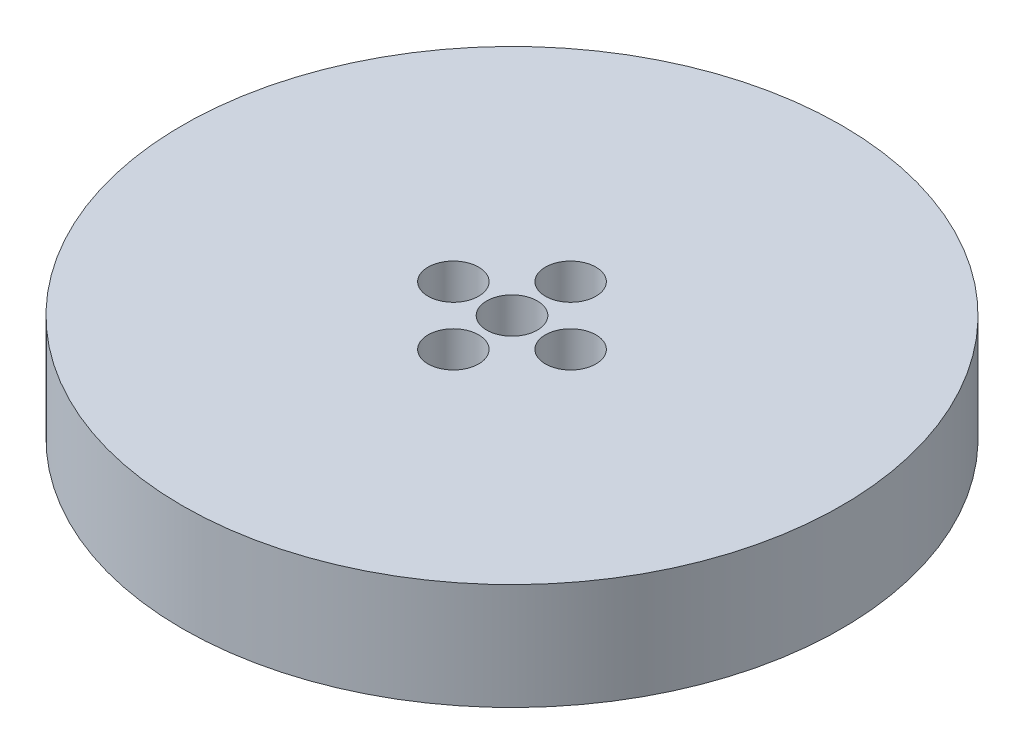
ISO-10303-21;
HEADER;
FILE_DESCRIPTION(('STEP AP214'),'2;1');
FILE_NAME('part.step','',(''),(''),'','','');
FILE_SCHEMA(('AUTOMOTIVE_DESIGN { 1 0 10303 214 1 1 1 1 }'));
ENDSEC;
DATA;
#1=APPLICATION_CONTEXT('core data for automotive mechanical design processes');
#2=APPLICATION_PROTOCOL_DEFINITION('international standard','automotive_design',2000,#1);
#3=PRODUCT_CONTEXT('',#1,'mechanical');
#4=PRODUCT('Part','Part','',(#3));
#5=PRODUCT_RELATED_PRODUCT_CATEGORY('part','',(#4));
#6=PRODUCT_DEFINITION_FORMATION('','',#4);
#7=PRODUCT_DEFINITION_CONTEXT('part definition',#1,'design');
#8=PRODUCT_DEFINITION('design','',#6,#7);
#9=PRODUCT_DEFINITION_SHAPE('','',#8);
#10=(LENGTH_UNIT() NAMED_UNIT(*) SI_UNIT(.MILLI.,.METRE.));
#11=(NAMED_UNIT(*) PLANE_ANGLE_UNIT() SI_UNIT($,.RADIAN.));
#12=(NAMED_UNIT(*) SI_UNIT($,.STERADIAN.) SOLID_ANGLE_UNIT());
#13=UNCERTAINTY_MEASURE_WITH_UNIT(LENGTH_MEASURE(1.E-05),#10,'distance_accuracy_value','');
#14=(GEOMETRIC_REPRESENTATION_CONTEXT(3) GLOBAL_UNCERTAINTY_ASSIGNED_CONTEXT((#13)) GLOBAL_UNIT_ASSIGNED_CONTEXT((#10,
#11,#12)) REPRESENTATION_CONTEXT('',''));
#15=CARTESIAN_POINT('',(0.,0.,0.));
#16=DIRECTION('',(0.,0.,1.));
#17=DIRECTION('',(1.,0.,0.));
#18=AXIS2_PLACEMENT_3D('',#15,#16,#17);
#19=CARTESIAN_POINT('',(0.,21.,0.));
#20=DIRECTION('',(0.,-1.,0.));
#21=DIRECTION('',(0.,0.,-1.));
#22=AXIS2_PLACEMENT_3D('',#19,#20,#21);
#23=CYLINDRICAL_SURFACE('',#22,65.);
#24=CARTESIAN_POINT('',(0.,21.,0.));
#25=DIRECTION('',(0.,1.,0.));
#26=DIRECTION('',(0.,0.,1.));
#27=AXIS2_PLACEMENT_3D('',#24,#25,#26);
#28=CIRCLE('',#27,65.);
#29=CARTESIAN_POINT('',(0.,21.,-65.));
#30=VERTEX_POINT('',#29);
#31=EDGE_CURVE('E10',#30,#30,#28,.T.);
#32=CARTESIAN_POINT('',(0.,0.,0.));
#33=DIRECTION('',(0.,1.,0.));
#34=DIRECTION('',(0.,0.,1.));
#35=AXIS2_PLACEMENT_3D('',#32,#33,#34);
#36=CIRCLE('',#35,65.);
#37=CARTESIAN_POINT('',(0.,0.,-65.));
#38=VERTEX_POINT('',#37);
#39=EDGE_CURVE('E37',#38,#38,#36,.T.);
#40=CARTESIAN_POINT('',(0.,21.,-65.));
#41=CARTESIAN_POINT('',(0.,20.78125,-65.));
#42=CARTESIAN_POINT('',(0.,20.5625,-65.));
#43=CARTESIAN_POINT('',(0.,20.125,-65.));
#44=CARTESIAN_POINT('',(0.,19.90625,-65.));
#45=CARTESIAN_POINT('',(0.,19.46875,-65.));
#46=CARTESIAN_POINT('',(0.,19.25,-65.));
#47=CARTESIAN_POINT('',(0.,18.8125,-65.));
#48=CARTESIAN_POINT('',(0.,18.59375,-65.));
#49=CARTESIAN_POINT('',(0.,18.15625,-65.));
#50=CARTESIAN_POINT('',(0.,17.9375,-65.));
#51=CARTESIAN_POINT('',(0.,17.5,-65.));
#52=CARTESIAN_POINT('',(0.,17.28125,-65.));
#53=CARTESIAN_POINT('',(0.,16.84375,-65.));
#54=CARTESIAN_POINT('',(0.,16.625,-65.));
#55=CARTESIAN_POINT('',(0.,16.1875,-65.));
#56=CARTESIAN_POINT('',(0.,15.96875,-65.));
#57=CARTESIAN_POINT('',(0.,15.53125,-65.));
#58=CARTESIAN_POINT('',(0.,15.3125,-65.));
#59=CARTESIAN_POINT('',(0.,14.875,-65.));
#60=CARTESIAN_POINT('',(0.,14.65625,-65.));
#61=CARTESIAN_POINT('',(0.,14.21875,-65.));
#62=CARTESIAN_POINT('',(0.,14.,-65.));
#63=CARTESIAN_POINT('',(0.,13.5625,-65.));
#64=CARTESIAN_POINT('',(0.,13.34375,-65.));
#65=CARTESIAN_POINT('',(0.,12.90625,-65.));
#66=CARTESIAN_POINT('',(0.,12.6875,-65.));
#67=CARTESIAN_POINT('',(0.,12.25,-65.));
#68=CARTESIAN_POINT('',(0.,12.03125,-65.));
#69=CARTESIAN_POINT('',(0.,11.59375,-65.));
#70=CARTESIAN_POINT('',(0.,11.375,-65.));
#71=CARTESIAN_POINT('',(0.,10.9375,-65.));
#72=CARTESIAN_POINT('',(0.,10.71875,-65.));
#73=CARTESIAN_POINT('',(0.,10.28125,-65.));
#74=CARTESIAN_POINT('',(0.,10.0625,-65.));
#75=CARTESIAN_POINT('',(0.,9.625,-65.));
#76=CARTESIAN_POINT('',(0.,9.40625,-65.));
#77=CARTESIAN_POINT('',(0.,8.96875,-65.));
#78=CARTESIAN_POINT('',(0.,8.75,-65.));
#79=CARTESIAN_POINT('',(0.,8.3125,-65.));
#80=CARTESIAN_POINT('',(0.,8.09375,-65.));
#81=CARTESIAN_POINT('',(0.,7.65625,-65.));
#82=CARTESIAN_POINT('',(0.,7.4375,-65.));
#83=CARTESIAN_POINT('',(0.,7.,-65.));
#84=CARTESIAN_POINT('',(0.,6.78125,-65.));
#85=CARTESIAN_POINT('',(0.,6.34375,-65.));
#86=CARTESIAN_POINT('',(0.,6.125,-65.));
#87=CARTESIAN_POINT('',(0.,5.6875,-65.));
#88=CARTESIAN_POINT('',(0.,5.46875,-65.));
#89=CARTESIAN_POINT('',(0.,5.03125,-65.));
#90=CARTESIAN_POINT('',(0.,4.8125,-65.));
#91=CARTESIAN_POINT('',(0.,4.375,-65.));
#92=CARTESIAN_POINT('',(0.,4.15625,-65.));
#93=CARTESIAN_POINT('',(0.,3.71875,-65.));
#94=CARTESIAN_POINT('',(0.,3.5,-65.));
#95=CARTESIAN_POINT('',(0.,3.0625,-65.));
#96=CARTESIAN_POINT('',(0.,2.84375,-65.));
#97=CARTESIAN_POINT('',(0.,2.40625,-65.));
#98=CARTESIAN_POINT('',(0.,2.1875,-65.));
#99=CARTESIAN_POINT('',(0.,1.75,-65.));
#100=CARTESIAN_POINT('',(0.,1.53125,-65.));
#101=CARTESIAN_POINT('',(0.,1.09375,-65.));
#102=CARTESIAN_POINT('',(0.,0.875000000000001,-65.));
#103=CARTESIAN_POINT('',(0.,0.4375,-65.));
#104=CARTESIAN_POINT('',(0.,0.21875,-65.));
#105=CARTESIAN_POINT('',(0.,0.,-65.));
#106=B_SPLINE_CURVE_WITH_KNOTS('',3,(#40,#41,#42,#43,#44,#45,#46,#47,#48,#49,#50,#51,#52,#53,
#54,#55,#56,#57,#58,#59,#60,#61,#62,#63,#64,#65,#66,#67,#68,#69,#70,#71,#72,#73,#74,#75,#76,#77,
#78,#79,#80,#81,#82,#83,#84,#85,#86,#87,#88,#89,#90,#91,#92,#93,#94,#95,#96,#97,#98,#99,#100,
#101,#102,#103,#104,#105),.UNSPECIFIED.,.F.,.F.,(4,2,2,2,2,2,2,2,2,2,2,2,2,2,2,2,2,2,2,2,2,2,2,
2,2,2,2,2,2,2,2,2,4),(0.,0.656249999999997,1.3125,1.96875,2.625,3.28125,3.9375,4.59375,5.25,
5.90625,6.5625,7.21875,7.875,8.53125,9.1875,9.84375,10.5,11.15625,11.8125,12.46875,13.125,
13.78125,14.4375,15.09375,15.75,16.40625,17.0625,17.71875,18.375,19.03125,19.6875,20.34375,21.),.UNSPECIFIED.);
#107=EDGE_CURVE('BSEAM40',#30,#38,#106,.T.);
#108=ORIENTED_EDGE('',*,*,#31,.F.);
#109=ORIENTED_EDGE('',*,*,#39,.T.);
#110=ORIENTED_EDGE('',*,*,#107,.T.);
#111=ORIENTED_EDGE('',*,*,#107,.F.);
#112=EDGE_LOOP('',(#108,#110,#109,#111));
#113=FACE_BOUND('',#112,.T.);
#114=ADVANCED_FACE('F40',(#113),#23,.T.);
#115=CARTESIAN_POINT('',(0.,21.,0.));
#116=DIRECTION('',(0.,1.,0.));
#117=DIRECTION('',(0.,0.,1.));
#118=AXIS2_PLACEMENT_3D('',#115,#116,#117);
#119=PLANE('',#118);
#120=CARTESIAN_POINT('',(0.,21.,11.566878070459));
#121=DIRECTION('',(0.,1.,0.));
#122=DIRECTION('',(1.,0.,0.));
#123=AXIS2_PLACEMENT_3D('',#120,#121,#122);
#124=CIRCLE('',#123,4.98679283531903);
#125=CARTESIAN_POINT('',(4.98679283531908,21.,11.5668780704589));
#126=VERTEX_POINT('',#125);
#127=EDGE_CURVE('E71',#126,#126,#124,.T.);
#128=ORIENTED_EDGE('',*,*,#127,.F.);
#129=EDGE_LOOP('',(#128));
#130=FACE_BOUND('',#129,.T.);
#131=CARTESIAN_POINT('',(11.566878070459,21.,0.));
#132=DIRECTION('',(0.,1.,0.));
#133=DIRECTION('',(0.,0.,-1.));
#134=AXIS2_PLACEMENT_3D('',#131,#132,#133);
#135=CIRCLE('',#134,4.98679283531903);
#136=CARTESIAN_POINT('',(11.566878070459,21.,-4.98679283531903));
#137=VERTEX_POINT('',#136);
#138=EDGE_CURVE('E70',#137,#137,#135,.T.);
#139=ORIENTED_EDGE('',*,*,#138,.F.);
#140=EDGE_LOOP('',(#139));
#141=FACE_BOUND('',#140,.T.);
#142=CARTESIAN_POINT('',(-1.21156616795044E-13,21.,-11.566878070459));
#143=DIRECTION('',(0.,1.,0.));
#144=DIRECTION('',(-1.,0.,0.));
#145=AXIS2_PLACEMENT_3D('',#142,#143,#144);
#146=CIRCLE('',#145,4.98679283531903);
#147=CARTESIAN_POINT('',(-4.98679283531916,21.,-11.5668780704589));
#148=VERTEX_POINT('',#147);
#149=EDGE_CURVE('E61',#148,#148,#146,.T.);
#150=ORIENTED_EDGE('',*,*,#149,.F.);
#151=EDGE_LOOP('',(#150));
#152=FACE_BOUND('',#151,.T.);
#153=CARTESIAN_POINT('',(-11.566878070459,21.,0.));
#154=DIRECTION('',(0.,1.,0.));
#155=DIRECTION('',(0.,0.,1.));
#156=AXIS2_PLACEMENT_3D('',#153,#154,#155);
#157=CIRCLE('',#156,4.98679283531903);
#158=CARTESIAN_POINT('',(-11.566878070459,21.,4.98679283531903));
#159=VERTEX_POINT('',#158);
#160=EDGE_CURVE('E54',#159,#159,#157,.T.);
#161=ORIENTED_EDGE('',*,*,#160,.F.);
#162=EDGE_LOOP('',(#161));
#163=FACE_BOUND('',#162,.T.);
#164=CARTESIAN_POINT('',(0.,21.,0.));
#165=DIRECTION('',(0.,1.,0.));
#166=DIRECTION('',(0.,0.,1.));
#167=AXIS2_PLACEMENT_3D('',#164,#165,#166);
#168=CIRCLE('',#167,5.);
#169=CARTESIAN_POINT('',(0.,21.,-5.));
#170=VERTEX_POINT('',#169);
#171=EDGE_CURVE('E50',#170,#170,#168,.T.);
#172=ORIENTED_EDGE('',*,*,#171,.F.);
#173=EDGE_LOOP('',(#172));
#174=FACE_BOUND('',#173,.T.);
#175=ORIENTED_EDGE('',*,*,#31,.T.);
#176=EDGE_LOOP('',(#175));
#177=FACE_BOUND('',#176,.T.);
#178=ADVANCED_FACE('F86',(#130,#141,#152,#163,#174,#177),#119,.T.);
#179=CARTESIAN_POINT('',(0.,0.,0.));
#180=DIRECTION('',(0.,1.,0.));
#181=DIRECTION('',(0.,0.,1.));
#182=AXIS2_PLACEMENT_3D('',#179,#180,#181);
#183=PLANE('',#182);
#184=CARTESIAN_POINT('',(0.,0.,0.));
#185=DIRECTION('',(0.,1.,0.));
#186=DIRECTION('',(0.,0.,1.));
#187=AXIS2_PLACEMENT_3D('',#184,#185,#186);
#188=CIRCLE('',#187,5.);
#189=CARTESIAN_POINT('',(0.,0.,-5.));
#190=VERTEX_POINT('',#189);
#191=EDGE_CURVE('E47',#190,#190,#188,.T.);
#192=ORIENTED_EDGE('',*,*,#191,.T.);
#193=EDGE_LOOP('',(#192));
#194=FACE_BOUND('',#193,.T.);
#195=ORIENTED_EDGE('',*,*,#39,.F.);
#196=EDGE_LOOP('',(#195));
#197=FACE_BOUND('',#196,.T.);
#198=ADVANCED_FACE('F93',(#194,#197),#183,.F.);
#199=CARTESIAN_POINT('',(0.,21.,0.));
#200=DIRECTION('',(0.,-1.,0.));
#201=DIRECTION('',(0.,0.,-1.));
#202=AXIS2_PLACEMENT_3D('',#199,#200,#201);
#203=CYLINDRICAL_SURFACE('',#202,5.);
#204=CARTESIAN_POINT('',(0.,21.,-5.));
#205=CARTESIAN_POINT('',(0.,20.78125,-5.));
#206=CARTESIAN_POINT('',(0.,20.5625,-5.));
#207=CARTESIAN_POINT('',(0.,20.125,-5.));
#208=CARTESIAN_POINT('',(0.,19.90625,-5.));
#209=CARTESIAN_POINT('',(0.,19.46875,-5.));
#210=CARTESIAN_POINT('',(0.,19.25,-5.));
#211=CARTESIAN_POINT('',(0.,18.8125,-5.));
#212=CARTESIAN_POINT('',(0.,18.59375,-5.));
#213=CARTESIAN_POINT('',(0.,18.15625,-5.));
#214=CARTESIAN_POINT('',(0.,17.9375,-5.));
#215=CARTESIAN_POINT('',(0.,17.5,-5.));
#216=CARTESIAN_POINT('',(0.,17.28125,-5.));
#217=CARTESIAN_POINT('',(0.,16.84375,-5.));
#218=CARTESIAN_POINT('',(0.,16.625,-5.));
#219=CARTESIAN_POINT('',(0.,16.1875,-5.));
#220=CARTESIAN_POINT('',(0.,15.96875,-5.));
#221=CARTESIAN_POINT('',(0.,15.53125,-5.));
#222=CARTESIAN_POINT('',(0.,15.3125,-5.));
#223=CARTESIAN_POINT('',(0.,14.875,-5.));
#224=CARTESIAN_POINT('',(0.,14.65625,-5.));
#225=CARTESIAN_POINT('',(0.,14.21875,-5.));
#226=CARTESIAN_POINT('',(0.,14.,-5.));
#227=CARTESIAN_POINT('',(0.,13.5625,-5.));
#228=CARTESIAN_POINT('',(0.,13.34375,-5.));
#229=CARTESIAN_POINT('',(0.,12.90625,-5.));
#230=CARTESIAN_POINT('',(0.,12.6875,-5.));
#231=CARTESIAN_POINT('',(0.,12.25,-5.));
#232=CARTESIAN_POINT('',(0.,12.03125,-5.));
#233=CARTESIAN_POINT('',(0.,11.59375,-5.));
#234=CARTESIAN_POINT('',(0.,11.375,-5.));
#235=CARTESIAN_POINT('',(0.,10.9375,-5.));
#236=CARTESIAN_POINT('',(0.,10.71875,-5.));
#237=CARTESIAN_POINT('',(0.,10.28125,-5.));
#238=CARTESIAN_POINT('',(0.,10.0625,-5.));
#239=CARTESIAN_POINT('',(0.,9.625,-5.));
#240=CARTESIAN_POINT('',(0.,9.40625,-5.));
#241=CARTESIAN_POINT('',(0.,8.96875,-5.));
#242=CARTESIAN_POINT('',(0.,8.75,-5.));
#243=CARTESIAN_POINT('',(0.,8.3125,-5.));
#244=CARTESIAN_POINT('',(0.,8.09375,-5.));
#245=CARTESIAN_POINT('',(0.,7.65625,-5.));
#246=CARTESIAN_POINT('',(0.,7.4375,-5.));
#247=CARTESIAN_POINT('',(0.,7.,-5.));
#248=CARTESIAN_POINT('',(0.,6.78125,-5.));
#249=CARTESIAN_POINT('',(0.,6.34375,-5.));
#250=CARTESIAN_POINT('',(0.,6.125,-5.));
#251=CARTESIAN_POINT('',(0.,5.6875,-5.));
#252=CARTESIAN_POINT('',(0.,5.46875,-5.));
#253=CARTESIAN_POINT('',(0.,5.03125,-5.));
#254=CARTESIAN_POINT('',(0.,4.8125,-5.));
#255=CARTESIAN_POINT('',(0.,4.375,-5.));
#256=CARTESIAN_POINT('',(0.,4.15625,-5.));
#257=CARTESIAN_POINT('',(0.,3.71875,-5.));
#258=CARTESIAN_POINT('',(0.,3.5,-5.));
#259=CARTESIAN_POINT('',(0.,3.0625,-5.));
#260=CARTESIAN_POINT('',(0.,2.84375,-5.));
#261=CARTESIAN_POINT('',(0.,2.40625,-5.));
#262=CARTESIAN_POINT('',(0.,2.1875,-5.));
#263=CARTESIAN_POINT('',(0.,1.75,-5.));
#264=CARTESIAN_POINT('',(0.,1.53125,-5.));
#265=CARTESIAN_POINT('',(0.,1.09375,-5.));
#266=CARTESIAN_POINT('',(0.,0.875000000000001,-5.));
#267=CARTESIAN_POINT('',(0.,0.4375,-5.));
#268=CARTESIAN_POINT('',(0.,0.21875,-5.));
#269=CARTESIAN_POINT('',(0.,0.,-5.));
#270=B_SPLINE_CURVE_WITH_KNOTS('',3,(#204,#205,#206,#207,#208,#209,#210,#211,#212,#213,#214,
#215,#216,#217,#218,#219,#220,#221,#222,#223,#224,#225,#226,#227,#228,#229,#230,#231,#232,#233,
#234,#235,#236,#237,#238,#239,#240,#241,#242,#243,#244,#245,#246,#247,#248,#249,#250,#251,#252,
#253,#254,#255,#256,#257,#258,#259,#260,#261,#262,#263,#264,#265,#266,#267,#268,#269),
.UNSPECIFIED.,.F.,.F.,(4,2,2,2,2,2,2,2,2,2,2,2,2,2,2,2,2,2,2,2,2,2,2,2,2,2,2,2,2,2,2,2,4),(0.,
0.656250000000001,1.3125,1.96875,2.625,3.28125,3.9375,4.59375,5.25,5.90625,6.5625,7.21875,7.875,
8.53125,9.1875,9.84375,10.5,11.15625,11.8125,12.46875,13.125,13.78125,14.4375,15.09375,15.75,
16.40625,17.0625,17.71875,18.375,19.03125,19.6875,20.34375,21.),.UNSPECIFIED.);
#271=EDGE_CURVE('BSEAM101',#170,#190,#270,.T.);
#272=ORIENTED_EDGE('',*,*,#171,.T.);
#273=ORIENTED_EDGE('',*,*,#191,.F.);
#274=ORIENTED_EDGE('',*,*,#271,.T.);
#275=ORIENTED_EDGE('',*,*,#271,.F.);
#276=EDGE_LOOP('',(#272,#274,#273,#275));
#277=FACE_BOUND('',#276,.T.);
#278=ADVANCED_FACE('F101',(#277),#203,.F.);
#279=CARTESIAN_POINT('',(-11.566878070459,2.9935599287704,0.));
#280=DIRECTION('',(0.,1.,0.));
#281=DIRECTION('',(0.,0.,1.));
#282=AXIS2_PLACEMENT_3D('',#279,#280,#281);
#283=CYLINDRICAL_SURFACE('',#282,4.98679283531903);
#284=CARTESIAN_POINT('',(-11.566878070459,2.9935599287704,0.));
#285=DIRECTION('',(0.,1.,0.));
#286=DIRECTION('',(0.,0.,1.));
#287=AXIS2_PLACEMENT_3D('',#284,#285,#286);
#288=CIRCLE('',#287,4.98679283531903);
#289=CARTESIAN_POINT('',(-11.566878070459,2.9935599287704,4.98679283531903));
#290=VERTEX_POINT('',#289);
#291=EDGE_CURVE('E55',#290,#290,#288,.T.);
#292=ORIENTED_EDGE('',*,*,#291,.F.);
#293=EDGE_LOOP('',(#292));
#294=FACE_BOUND('',#293,.T.);
#295=ORIENTED_EDGE('',*,*,#160,.T.);
#296=EDGE_LOOP('',(#295));
#297=FACE_BOUND('',#296,.T.);
#298=ADVANCED_FACE('F102',(#294,#297),#283,.F.);
#299=CARTESIAN_POINT('',(-11.566878070459,2.9935599287704,0.));
#300=DIRECTION('',(0.,1.,0.));
#301=DIRECTION('',(0.,0.,1.));
#302=AXIS2_PLACEMENT_3D('',#299,#300,#301);
#303=PLANE('',#302);
#304=ORIENTED_EDGE('',*,*,#291,.T.);
#305=EDGE_LOOP('',(#304));
#306=FACE_BOUND('',#305,.T.);
#307=ADVANCED_FACE('F133',(#306),#303,.T.);
#308=CARTESIAN_POINT('',(-1.21156616795044E-13,2.9935599287704,-11.566878070459));
#309=DIRECTION('',(0.,1.,0.));
#310=DIRECTION('',(0.,0.,1.));
#311=AXIS2_PLACEMENT_3D('',#308,#309,#310);
#312=CYLINDRICAL_SURFACE('',#311,4.98679283531903);
#313=CARTESIAN_POINT('',(-1.21156616795044E-13,2.9935599287704,-11.566878070459));
#314=DIRECTION('',(0.,1.,0.));
#315=DIRECTION('',(-1.,0.,0.));
#316=AXIS2_PLACEMENT_3D('',#313,#314,#315);
#317=CIRCLE('',#316,4.98679283531903);
#318=CARTESIAN_POINT('',(-4.98679283531916,2.9935599287704,-11.5668780704589));
#319=VERTEX_POINT('',#318);
#320=EDGE_CURVE('E63',#319,#319,#317,.T.);
#321=ORIENTED_EDGE('',*,*,#320,.F.);
#322=EDGE_LOOP('',(#321));
#323=FACE_BOUND('',#322,.T.);
#324=ORIENTED_EDGE('',*,*,#149,.T.);
#325=EDGE_LOOP('',(#324));
#326=FACE_BOUND('',#325,.T.);
#327=ADVANCED_FACE('F142',(#323,#326),#312,.F.);
#328=CARTESIAN_POINT('',(-1.21156616795044E-13,2.9935599287704,-11.566878070459));
#329=DIRECTION('',(0.,1.,0.));
#330=DIRECTION('',(-1.,0.,0.));
#331=AXIS2_PLACEMENT_3D('',#328,#329,#330);
#332=PLANE('',#331);
#333=ORIENTED_EDGE('',*,*,#320,.T.);
#334=EDGE_LOOP('',(#333));
#335=FACE_BOUND('',#334,.T.);
#336=ADVANCED_FACE('F156',(#335),#332,.T.);
#337=CARTESIAN_POINT('',(11.566878070459,2.9935599287704,0.));
#338=DIRECTION('',(0.,1.,0.));
#339=DIRECTION('',(0.,0.,1.));
#340=AXIS2_PLACEMENT_3D('',#337,#338,#339);
#341=CYLINDRICAL_SURFACE('',#340,4.98679283531903);
#342=CARTESIAN_POINT('',(11.566878070459,2.9935599287704,0.));
#343=DIRECTION('',(0.,1.,0.));
#344=DIRECTION('',(0.,0.,-1.));
#345=AXIS2_PLACEMENT_3D('',#342,#343,#344);
#346=CIRCLE('',#345,4.98679283531903);
#347=CARTESIAN_POINT('',(11.566878070459,2.9935599287704,-4.98679283531903));
#348=VERTEX_POINT('',#347);
#349=EDGE_CURVE('E69',#348,#348,#346,.T.);
#350=ORIENTED_EDGE('',*,*,#349,.F.);
#351=EDGE_LOOP('',(#350));
#352=FACE_BOUND('',#351,.T.);
#353=ORIENTED_EDGE('',*,*,#138,.T.);
#354=EDGE_LOOP('',(#353));
#355=FACE_BOUND('',#354,.T.);
#356=ADVANCED_FACE('F164',(#352,#355),#341,.F.);
#357=CARTESIAN_POINT('',(11.566878070459,2.9935599287704,0.));
#358=DIRECTION('',(0.,1.,0.));
#359=DIRECTION('',(0.,0.,-1.));
#360=AXIS2_PLACEMENT_3D('',#357,#358,#359);
#361=PLANE('',#360);
#362=ORIENTED_EDGE('',*,*,#349,.T.);
#363=EDGE_LOOP('',(#362));
#364=FACE_BOUND('',#363,.T.);
#365=ADVANCED_FACE('F83',(#364),#361,.T.);
#366=CARTESIAN_POINT('',(0.,2.9935599287704,11.566878070459));
#367=DIRECTION('',(0.,1.,0.));
#368=DIRECTION('',(0.,0.,1.));
#369=AXIS2_PLACEMENT_3D('',#366,#367,#368);
#370=CYLINDRICAL_SURFACE('',#369,4.98679283531903);
#371=CARTESIAN_POINT('',(0.,2.9935599287704,11.566878070459));
#372=DIRECTION('',(0.,1.,0.));
#373=DIRECTION('',(1.,0.,0.));
#374=AXIS2_PLACEMENT_3D('',#371,#372,#373);
#375=CIRCLE('',#374,4.98679283531903);
#376=CARTESIAN_POINT('',(4.98679283531908,2.9935599287704,11.5668780704589));
#377=VERTEX_POINT('',#376);
#378=EDGE_CURVE('E59',#377,#377,#375,.T.);
#379=ORIENTED_EDGE('',*,*,#378,.F.);
#380=EDGE_LOOP('',(#379));
#381=FACE_BOUND('',#380,.T.);
#382=ORIENTED_EDGE('',*,*,#127,.T.);
#383=EDGE_LOOP('',(#382));
#384=FACE_BOUND('',#383,.T.);
#385=ADVANCED_FACE('F81',(#381,#384),#370,.F.);
#386=CARTESIAN_POINT('',(0.,2.9935599287704,11.566878070459));
#387=DIRECTION('',(0.,1.,0.));
#388=DIRECTION('',(1.,0.,0.));
#389=AXIS2_PLACEMENT_3D('',#386,#387,#388);
#390=PLANE('',#389);
#391=ORIENTED_EDGE('',*,*,#378,.T.);
#392=EDGE_LOOP('',(#391));
#393=FACE_BOUND('',#392,.T.);
#394=ADVANCED_FACE('F78',(#393),#390,.T.);
#395=CLOSED_SHELL('',(#114,#178,#198,#278,#298,#307,#327,#336,#356,#365,#385,#394));
#396=MANIFOLD_SOLID_BREP('B2',#395);
#397=ADVANCED_BREP_SHAPE_REPRESENTATION('',(#18,#396),#14);
#398=SHAPE_DEFINITION_REPRESENTATION(#9,#397);
ENDSEC;
END-ISO-10303-21;
